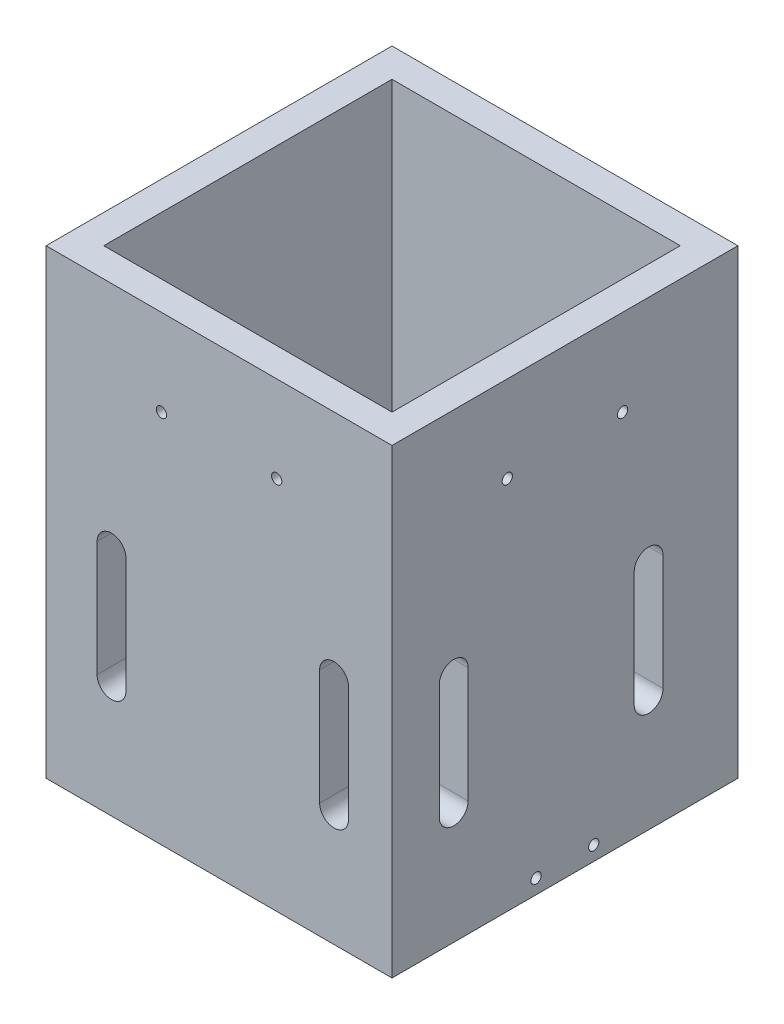
ISO-10303-21;
HEADER;
FILE_DESCRIPTION(('STEP AP214'),'2;1');
FILE_NAME('part.step','',(''),(''),'','','');
FILE_SCHEMA(('AUTOMOTIVE_DESIGN { 1 0 10303 214 1 1 1 1 }'));
ENDSEC;
DATA;
#1=APPLICATION_CONTEXT('core data for automotive mechanical design processes');
#2=APPLICATION_PROTOCOL_DEFINITION('international standard','automotive_design',2000,#1);
#3=PRODUCT_CONTEXT('',#1,'mechanical');
#4=PRODUCT('Part','Part','',(#3));
#5=PRODUCT_RELATED_PRODUCT_CATEGORY('part','',(#4));
#6=PRODUCT_DEFINITION_FORMATION('','',#4);
#7=PRODUCT_DEFINITION_CONTEXT('part definition',#1,'design');
#8=PRODUCT_DEFINITION('design','',#6,#7);
#9=PRODUCT_DEFINITION_SHAPE('','',#8);
#10=(LENGTH_UNIT() NAMED_UNIT(*) SI_UNIT(.MILLI.,.METRE.));
#11=(NAMED_UNIT(*) PLANE_ANGLE_UNIT() SI_UNIT($,.RADIAN.));
#12=(NAMED_UNIT(*) SI_UNIT($,.STERADIAN.) SOLID_ANGLE_UNIT());
#13=UNCERTAINTY_MEASURE_WITH_UNIT(LENGTH_MEASURE(1.E-05),#10,'distance_accuracy_value','');
#14=(GEOMETRIC_REPRESENTATION_CONTEXT(3) GLOBAL_UNCERTAINTY_ASSIGNED_CONTEXT((#13)) GLOBAL_UNIT_ASSIGNED_CONTEXT((#10,
#11,#12)) REPRESENTATION_CONTEXT('',''));
#15=CARTESIAN_POINT('',(0.,0.,0.));
#16=DIRECTION('',(0.,0.,1.));
#17=DIRECTION('',(1.,0.,0.));
#18=AXIS2_PLACEMENT_3D('',#15,#16,#17);
#19=CARTESIAN_POINT('',(-39.4321678321678,101.6,-32.9489510489511));
#20=DIRECTION('',(1.,0.,0.));
#21=DIRECTION('',(0.,0.,-1.));
#22=AXIS2_PLACEMENT_3D('',#19,#20,#21);
#23=PLANE('',#22);
#24=CARTESIAN_POINT('',(-39.4321678321678,3.175,-1.19895104895105));
#25=DIRECTION('',(1.,0.,0.));
#26=DIRECTION('',(0.,0.,-1.));
#27=AXIS2_PLACEMENT_3D('',#24,#25,#26);
#28=CIRCLE('',#27,1.13029999999998);
#29=CARTESIAN_POINT('',(-39.4321678321678,3.175,-2.32925104895103));
#30=VERTEX_POINT('',#29);
#31=EDGE_CURVE('E450',#30,#30,#28,.T.);
#32=ORIENTED_EDGE('',*,*,#31,.T.);
#33=EDGE_LOOP('',(#32));
#34=FACE_BOUND('',#33,.T.);
#35=CARTESIAN_POINT('',(-39.4321678321678,3.175,11.501048951049));
#36=DIRECTION('',(1.,0.,0.));
#37=DIRECTION('',(0.,0.,-1.));
#38=AXIS2_PLACEMENT_3D('',#35,#36,#37);
#39=CIRCLE('',#38,1.13029999999998);
#40=CARTESIAN_POINT('',(-39.4321678321678,3.175,10.370748951049));
#41=VERTEX_POINT('',#40);
#42=EDGE_CURVE('E378',#41,#41,#39,.T.);
#43=ORIENTED_EDGE('',*,*,#42,.T.);
#44=EDGE_LOOP('',(#43));
#45=FACE_BOUND('',#44,.T.);
#46=DIRECTION('',(0.,0.,1.));
#47=VECTOR('',#46,1.);
#48=CARTESIAN_POINT('',(-39.4321678321678,0.,-32.9489510489511));
#49=LINE('',#48,#47);
#50=CARTESIAN_POINT('',(-39.4321678321678,0.,-32.9489510489511));
#51=VERTEX_POINT('',#50);
#52=CARTESIAN_POINT('',(-39.4321678321678,0.,43.251048951049));
#53=VERTEX_POINT('',#52);
#54=EDGE_CURVE('E344',#51,#53,#49,.T.);
#55=ORIENTED_EDGE('',*,*,#54,.T.);
#56=DIRECTION('',(0.,-1.,0.));
#57=VECTOR('',#56,1.);
#58=CARTESIAN_POINT('',(-39.4321678321678,101.6,43.251048951049));
#59=LINE('',#58,#57);
#60=CARTESIAN_POINT('',(-39.4321678321678,101.6,43.251048951049));
#61=VERTEX_POINT('',#60);
#62=EDGE_CURVE('E11',#61,#53,#59,.T.);
#63=ORIENTED_EDGE('',*,*,#62,.F.);
#64=DIRECTION('',(0.,0.,1.));
#65=VECTOR('',#64,1.);
#66=CARTESIAN_POINT('',(-39.4321678321678,101.6,-32.9489510489511));
#67=LINE('',#66,#65);
#68=CARTESIAN_POINT('',(-39.4321678321678,101.6,-32.9489510489511));
#69=VERTEX_POINT('',#68);
#70=EDGE_CURVE('E351',#69,#61,#67,.T.);
#71=ORIENTED_EDGE('',*,*,#70,.F.);
#72=DIRECTION('',(0.,-1.,0.));
#73=VECTOR('',#72,1.);
#74=CARTESIAN_POINT('',(-39.4321678321678,101.6,-32.9489510489511));
#75=LINE('',#74,#73);
#76=EDGE_CURVE('E361',#69,#51,#75,.T.);
#77=ORIENTED_EDGE('',*,*,#76,.T.);
#78=EDGE_LOOP('',(#55,#63,#71,#77));
#79=FACE_BOUND('',#78,.T.);
#80=ADVANCED_FACE('F35',(#34,#45,#79),#23,.F.);
#81=CARTESIAN_POINT('',(-39.4321678321678,101.6,43.251048951049));
#82=DIRECTION('',(0.,0.,-1.));
#83=DIRECTION('',(-1.,0.,0.));
#84=AXIS2_PLACEMENT_3D('',#81,#82,#83);
#85=PLANE('',#84);
#86=CARTESIAN_POINT('',(-14.0321678321678,82.55,43.251048951049));
#87=DIRECTION('',(0.,0.,1.));
#88=DIRECTION('',(1.,0.,0.));
#89=AXIS2_PLACEMENT_3D('',#86,#87,#88);
#90=CIRCLE('',#89,1.13029999999999);
#91=CARTESIAN_POINT('',(-12.9018678321678,82.55,43.251048951049));
#92=VERTEX_POINT('',#91);
#93=EDGE_CURVE('E405',#92,#92,#90,.T.);
#94=ORIENTED_EDGE('',*,*,#93,.F.);
#95=EDGE_LOOP('',(#94));
#96=FACE_BOUND('',#95,.T.);
#97=CARTESIAN_POINT('',(11.3678321678322,82.55,43.251048951049));
#98=DIRECTION('',(0.,0.,1.));
#99=DIRECTION('',(1.,0.,0.));
#100=AXIS2_PLACEMENT_3D('',#97,#98,#99);
#101=CIRCLE('',#100,1.13029999999999);
#102=CARTESIAN_POINT('',(12.4981321678322,82.55,43.251048951049));
#103=VERTEX_POINT('',#102);
#104=EDGE_CURVE('E411',#103,#103,#101,.T.);
#105=ORIENTED_EDGE('',*,*,#104,.F.);
#106=EDGE_LOOP('',(#105));
#107=FACE_BOUND('',#106,.T.);
#108=CARTESIAN_POINT('',(24.0043321678322,50.8,43.251048951049));
#109=DIRECTION('',(0.,0.,1.));
#110=DIRECTION('',(1.,0.,0.));
#111=AXIS2_PLACEMENT_3D('',#108,#109,#110);
#112=CIRCLE('',#111,3.175);
#113=CARTESIAN_POINT('',(27.1793321678322,50.8,43.251048951049));
#114=VERTEX_POINT('',#113);
#115=CARTESIAN_POINT('',(20.8293321678322,50.8,43.251048951049));
#116=VERTEX_POINT('',#115);
#117=EDGE_CURVE('E262',#114,#116,#112,.T.);
#118=ORIENTED_EDGE('',*,*,#117,.F.);
#119=DIRECTION('',(0.,1.,0.));
#120=VECTOR('',#119,1.);
#121=CARTESIAN_POINT('',(27.1793321678322,25.4,43.251048951049));
#122=LINE('',#121,#120);
#123=CARTESIAN_POINT('',(27.1793321678322,25.4,43.251048951049));
#124=VERTEX_POINT('',#123);
#125=EDGE_CURVE('E265',#124,#114,#122,.T.);
#126=ORIENTED_EDGE('',*,*,#125,.F.);
#127=CARTESIAN_POINT('',(24.0043321678322,25.4,43.251048951049));
#128=DIRECTION('',(0.,0.,1.));
#129=DIRECTION('',(1.,0.,0.));
#130=AXIS2_PLACEMENT_3D('',#127,#128,#129);
#131=CIRCLE('',#130,3.175);
#132=CARTESIAN_POINT('',(20.8293321678322,25.4,43.251048951049));
#133=VERTEX_POINT('',#132);
#134=EDGE_CURVE('E268',#133,#124,#131,.T.);
#135=ORIENTED_EDGE('',*,*,#134,.F.);
#136=DIRECTION('',(0.,-1.,0.));
#137=VECTOR('',#136,1.);
#138=CARTESIAN_POINT('',(20.8293321678322,25.4,43.251048951049));
#139=LINE('',#138,#137);
#140=EDGE_CURVE('E259',#116,#133,#139,.T.);
#141=ORIENTED_EDGE('',*,*,#140,.F.);
#142=EDGE_LOOP('',(#118,#126,#135,#141));
#143=FACE_BOUND('',#142,.T.);
#144=CARTESIAN_POINT('',(-25.0176678321678,50.8,43.251048951049));
#145=DIRECTION('',(0.,0.,1.));
#146=DIRECTION('',(1.,0.,0.));
#147=AXIS2_PLACEMENT_3D('',#144,#145,#146);
#148=CIRCLE('',#147,3.17499999999999);
#149=CARTESIAN_POINT('',(-21.8426678321678,50.8,43.251048951049));
#150=VERTEX_POINT('',#149);
#151=CARTESIAN_POINT('',(-28.1926678321678,50.8,43.251048951049));
#152=VERTEX_POINT('',#151);
#153=EDGE_CURVE('E293',#150,#152,#148,.T.);
#154=ORIENTED_EDGE('',*,*,#153,.F.);
#155=DIRECTION('',(0.,1.,0.));
#156=VECTOR('',#155,1.);
#157=CARTESIAN_POINT('',(-21.8426678321678,25.4,43.251048951049));
#158=LINE('',#157,#156);
#159=CARTESIAN_POINT('',(-21.8426678321678,25.4,43.251048951049));
#160=VERTEX_POINT('',#159);
#161=EDGE_CURVE('E296',#160,#150,#158,.T.);
#162=ORIENTED_EDGE('',*,*,#161,.F.);
#163=CARTESIAN_POINT('',(-25.0176678321678,25.4,43.251048951049));
#164=DIRECTION('',(0.,0.,1.));
#165=DIRECTION('',(1.,0.,0.));
#166=AXIS2_PLACEMENT_3D('',#163,#164,#165);
#167=CIRCLE('',#166,3.17499999999999);
#168=CARTESIAN_POINT('',(-28.1926678321678,25.4,43.251048951049));
#169=VERTEX_POINT('',#168);
#170=EDGE_CURVE('E299',#169,#160,#167,.T.);
#171=ORIENTED_EDGE('',*,*,#170,.F.);
#172=DIRECTION('',(0.,-1.,0.));
#173=VECTOR('',#172,1.);
#174=CARTESIAN_POINT('',(-28.1926678321678,25.4,43.251048951049));
#175=LINE('',#174,#173);
#176=EDGE_CURVE('E290',#152,#169,#175,.T.);
#177=ORIENTED_EDGE('',*,*,#176,.F.);
#178=EDGE_LOOP('',(#154,#162,#171,#177));
#179=FACE_BOUND('',#178,.T.);
#180=DIRECTION('',(1.,0.,0.));
#181=VECTOR('',#180,1.);
#182=CARTESIAN_POINT('',(-39.4321678321678,0.,43.251048951049));
#183=LINE('',#182,#181);
#184=CARTESIAN_POINT('',(36.7678321678322,0.,43.251048951049));
#185=VERTEX_POINT('',#184);
#186=EDGE_CURVE('E364',#53,#185,#183,.T.);
#187=ORIENTED_EDGE('',*,*,#186,.T.);
#188=DIRECTION('',(0.,-1.,0.));
#189=VECTOR('',#188,1.);
#190=CARTESIAN_POINT('',(36.7678321678322,101.6,43.251048951049));
#191=LINE('',#190,#189);
#192=CARTESIAN_POINT('',(36.7678321678322,101.6,43.251048951049));
#193=VERTEX_POINT('',#192);
#194=EDGE_CURVE('E43',#193,#185,#191,.T.);
#195=ORIENTED_EDGE('',*,*,#194,.F.);
#196=DIRECTION('',(1.,0.,0.));
#197=VECTOR('',#196,1.);
#198=CARTESIAN_POINT('',(-39.4321678321678,101.6,43.251048951049));
#199=LINE('',#198,#197);
#200=EDGE_CURVE('E354',#61,#193,#199,.T.);
#201=ORIENTED_EDGE('',*,*,#200,.F.);
#202=ORIENTED_EDGE('',*,*,#62,.T.);
#203=EDGE_LOOP('',(#187,#195,#201,#202));
#204=FACE_BOUND('',#203,.T.);
#205=ADVANCED_FACE('F442',(#96,#107,#143,#179,#204),#85,.F.);
#206=CARTESIAN_POINT('',(36.7678321678322,101.6,-32.9489510489511));
#207=DIRECTION('',(-1.,0.,0.));
#208=DIRECTION('',(0.,0.,1.));
#209=AXIS2_PLACEMENT_3D('',#206,#207,#208);
#210=PLANE('',#209);
#211=CARTESIAN_POINT('',(36.7678321678322,3.175,-1.19895104895106));
#212=DIRECTION('',(1.,0.,0.));
#213=DIRECTION('',(0.,0.,-1.));
#214=AXIS2_PLACEMENT_3D('',#211,#212,#213);
#215=CIRCLE('',#214,1.13029999999999);
#216=CARTESIAN_POINT('',(36.7678321678322,3.175,-2.32925104895105));
#217=VERTEX_POINT('',#216);
#218=EDGE_CURVE('E733',#217,#217,#215,.T.);
#219=ORIENTED_EDGE('',*,*,#218,.F.);
#220=EDGE_LOOP('',(#219));
#221=FACE_BOUND('',#220,.T.);
#222=CARTESIAN_POINT('',(36.7678321678322,3.175,11.5010489510489));
#223=DIRECTION('',(1.,0.,0.));
#224=DIRECTION('',(0.,0.,-1.));
#225=AXIS2_PLACEMENT_3D('',#222,#223,#224);
#226=CIRCLE('',#225,1.13029999999999);
#227=CARTESIAN_POINT('',(36.7678321678322,3.175,10.370748951049));
#228=VERTEX_POINT('',#227);
#229=EDGE_CURVE('E385',#228,#228,#226,.T.);
#230=ORIENTED_EDGE('',*,*,#229,.F.);
#231=EDGE_LOOP('',(#230));
#232=FACE_BOUND('',#231,.T.);
#233=CARTESIAN_POINT('',(36.7678321678322,82.55,17.851048951049));
#234=DIRECTION('',(1.,0.,0.));
#235=DIRECTION('',(0.,0.,-1.));
#236=AXIS2_PLACEMENT_3D('',#233,#234,#235);
#237=CIRCLE('',#236,1.13029999999999);
#238=CARTESIAN_POINT('',(36.7678321678322,82.55,16.720748951049));
#239=VERTEX_POINT('',#238);
#240=EDGE_CURVE('E382',#239,#239,#237,.T.);
#241=ORIENTED_EDGE('',*,*,#240,.F.);
#242=EDGE_LOOP('',(#241));
#243=FACE_BOUND('',#242,.T.);
#244=CARTESIAN_POINT('',(36.7678321678322,82.55,-7.54895104895105));
#245=DIRECTION('',(1.,0.,0.));
#246=DIRECTION('',(0.,0.,-1.));
#247=AXIS2_PLACEMENT_3D('',#244,#245,#246);
#248=CIRCLE('',#247,1.13029999999999);
#249=CARTESIAN_POINT('',(36.7678321678322,82.55,-8.67925104895104));
#250=VERTEX_POINT('',#249);
#251=EDGE_CURVE('E399',#250,#250,#248,.T.);
#252=ORIENTED_EDGE('',*,*,#251,.F.);
#253=EDGE_LOOP('',(#252));
#254=FACE_BOUND('',#253,.T.);
#255=CARTESIAN_POINT('',(36.7678321678322,50.8,-13.276651048951));
#256=DIRECTION('',(1.,0.,0.));
#257=DIRECTION('',(0.,0.,-1.));
#258=AXIS2_PLACEMENT_3D('',#255,#256,#257);
#259=CIRCLE('',#258,3.175);
#260=CARTESIAN_POINT('',(36.7678321678322,50.8,-16.451651048951));
#261=VERTEX_POINT('',#260);
#262=CARTESIAN_POINT('',(36.7678321678322,50.8,-10.101651048951));
#263=VERTEX_POINT('',#262);
#264=EDGE_CURVE('E419',#261,#263,#259,.T.);
#265=ORIENTED_EDGE('',*,*,#264,.F.);
#266=DIRECTION('',(0.,1.,0.));
#267=VECTOR('',#266,1.);
#268=CARTESIAN_POINT('',(36.7678321678322,25.4,-16.451651048951));
#269=LINE('',#268,#267);
#270=CARTESIAN_POINT('',(36.7678321678322,25.4,-16.451651048951));
#271=VERTEX_POINT('',#270);
#272=EDGE_CURVE('E422',#271,#261,#269,.T.);
#273=ORIENTED_EDGE('',*,*,#272,.F.);
#274=CARTESIAN_POINT('',(36.7678321678322,25.4,-13.276651048951));
#275=DIRECTION('',(1.,0.,0.));
#276=DIRECTION('',(0.,0.,-1.));
#277=AXIS2_PLACEMENT_3D('',#274,#275,#276);
#278=CIRCLE('',#277,3.175);
#279=CARTESIAN_POINT('',(36.7678321678322,25.4,-10.101651048951));
#280=VERTEX_POINT('',#279);
#281=EDGE_CURVE('E217',#280,#271,#278,.T.);
#282=ORIENTED_EDGE('',*,*,#281,.F.);
#283=DIRECTION('',(0.,-1.,0.));
#284=VECTOR('',#283,1.);
#285=CARTESIAN_POINT('',(36.7678321678322,25.4,-10.101651048951));
#286=LINE('',#285,#284);
#287=EDGE_CURVE('E51',#263,#280,#286,.T.);
#288=ORIENTED_EDGE('',*,*,#287,.F.);
#289=EDGE_LOOP('',(#265,#273,#282,#288));
#290=FACE_BOUND('',#289,.T.);
#291=CARTESIAN_POINT('',(36.7678321678322,50.8,29.649348951049));
#292=DIRECTION('',(1.,0.,0.));
#293=DIRECTION('',(0.,0.,-1.));
#294=AXIS2_PLACEMENT_3D('',#291,#292,#293);
#295=CIRCLE('',#294,3.175);
#296=CARTESIAN_POINT('',(36.7678321678322,50.8,26.474348951049));
#297=VERTEX_POINT('',#296);
#298=CARTESIAN_POINT('',(36.7678321678322,50.8,32.824348951049));
#299=VERTEX_POINT('',#298);
#300=EDGE_CURVE('E231',#297,#299,#295,.T.);
#301=ORIENTED_EDGE('',*,*,#300,.F.);
#302=DIRECTION('',(0.,1.,0.));
#303=VECTOR('',#302,1.);
#304=CARTESIAN_POINT('',(36.7678321678322,25.4,26.474348951049));
#305=LINE('',#304,#303);
#306=CARTESIAN_POINT('',(36.7678321678322,25.4,26.474348951049));
#307=VERTEX_POINT('',#306);
#308=EDGE_CURVE('E234',#307,#297,#305,.T.);
#309=ORIENTED_EDGE('',*,*,#308,.F.);
#310=CARTESIAN_POINT('',(36.7678321678322,25.4,29.649348951049));
#311=DIRECTION('',(1.,0.,0.));
#312=DIRECTION('',(0.,0.,-1.));
#313=AXIS2_PLACEMENT_3D('',#310,#311,#312);
#314=CIRCLE('',#313,3.175);
#315=CARTESIAN_POINT('',(36.7678321678322,25.4,32.824348951049));
#316=VERTEX_POINT('',#315);
#317=EDGE_CURVE('E237',#316,#307,#314,.T.);
#318=ORIENTED_EDGE('',*,*,#317,.F.);
#319=DIRECTION('',(0.,-1.,0.));
#320=VECTOR('',#319,1.);
#321=CARTESIAN_POINT('',(36.7678321678322,25.4,32.824348951049));
#322=LINE('',#321,#320);
#323=EDGE_CURVE('E228',#299,#316,#322,.T.);
#324=ORIENTED_EDGE('',*,*,#323,.F.);
#325=EDGE_LOOP('',(#301,#309,#318,#324));
#326=FACE_BOUND('',#325,.T.);
#327=DIRECTION('',(0.,0.,-1.));
#328=VECTOR('',#327,1.);
#329=CARTESIAN_POINT('',(36.7678321678322,0.,-32.9489510489511));
#330=LINE('',#329,#328);
#331=CARTESIAN_POINT('',(36.7678321678322,0.,-32.9489510489511));
#332=VERTEX_POINT('',#331);
#333=EDGE_CURVE('E366',#185,#332,#330,.T.);
#334=ORIENTED_EDGE('',*,*,#333,.T.);
#335=DIRECTION('',(0.,-1.,0.));
#336=VECTOR('',#335,1.);
#337=CARTESIAN_POINT('',(36.7678321678322,101.6,-32.9489510489511));
#338=LINE('',#337,#336);
#339=CARTESIAN_POINT('',(36.7678321678322,101.6,-32.9489510489511));
#340=VERTEX_POINT('',#339);
#341=EDGE_CURVE('E371',#340,#332,#338,.T.);
#342=ORIENTED_EDGE('',*,*,#341,.F.);
#343=DIRECTION('',(0.,0.,-1.));
#344=VECTOR('',#343,1.);
#345=CARTESIAN_POINT('',(36.7678321678322,101.6,-32.9489510489511));
#346=LINE('',#345,#344);
#347=EDGE_CURVE('E357',#193,#340,#346,.T.);
#348=ORIENTED_EDGE('',*,*,#347,.F.);
#349=ORIENTED_EDGE('',*,*,#194,.T.);
#350=EDGE_LOOP('',(#334,#342,#348,#349));
#351=FACE_BOUND('',#350,.T.);
#352=ADVANCED_FACE('F427',(#221,#232,#243,#254,#290,#326,#351),#210,.F.);
#353=CARTESIAN_POINT('',(-39.4321678321678,101.6,-32.9489510489511));
#354=DIRECTION('',(0.,0.,1.));
#355=DIRECTION('',(1.,0.,0.));
#356=AXIS2_PLACEMENT_3D('',#353,#354,#355);
#357=PLANE('',#356);
#358=DIRECTION('',(-1.,0.,0.));
#359=VECTOR('',#358,1.);
#360=CARTESIAN_POINT('',(-39.4321678321678,0.,-32.9489510489511));
#361=LINE('',#360,#359);
#362=EDGE_CURVE('E355',#332,#51,#361,.T.);
#363=ORIENTED_EDGE('',*,*,#362,.T.);
#364=ORIENTED_EDGE('',*,*,#76,.F.);
#365=DIRECTION('',(-1.,0.,0.));
#366=VECTOR('',#365,1.);
#367=CARTESIAN_POINT('',(-39.4321678321678,101.6,-32.9489510489511));
#368=LINE('',#367,#366);
#369=EDGE_CURVE('E359',#340,#69,#368,.T.);
#370=ORIENTED_EDGE('',*,*,#369,.F.);
#371=ORIENTED_EDGE('',*,*,#341,.T.);
#372=EDGE_LOOP('',(#363,#364,#370,#371));
#373=FACE_BOUND('',#372,.T.);
#374=ADVANCED_FACE('F468',(#373),#357,.F.);
#375=CARTESIAN_POINT('',(0.,101.6,0.));
#376=DIRECTION('',(0.,1.,0.));
#377=DIRECTION('',(0.,0.,1.));
#378=AXIS2_PLACEMENT_3D('',#375,#376,#377);
#379=PLANE('',#378);
#380=DIRECTION('',(0.,0.,1.));
#381=VECTOR('',#380,1.);
#382=CARTESIAN_POINT('',(-33.0821678321678,101.6,-26.598951048951));
#383=LINE('',#382,#381);
#384=CARTESIAN_POINT('',(-33.0821678321678,101.6,-26.598951048951));
#385=VERTEX_POINT('',#384);
#386=CARTESIAN_POINT('',(-33.0821678321678,101.6,36.901048951049));
#387=VERTEX_POINT('',#386);
#388=EDGE_CURVE('E318',#385,#387,#383,.T.);
#389=ORIENTED_EDGE('',*,*,#388,.F.);
#390=DIRECTION('',(-1.,0.,0.));
#391=VECTOR('',#390,1.);
#392=CARTESIAN_POINT('',(-33.0821678321678,101.6,-26.598951048951));
#393=LINE('',#392,#391);
#394=CARTESIAN_POINT('',(30.4178321678322,101.6,-26.598951048951));
#395=VERTEX_POINT('',#394);
#396=EDGE_CURVE('E323',#395,#385,#393,.T.);
#397=ORIENTED_EDGE('',*,*,#396,.F.);
#398=DIRECTION('',(0.,0.,-1.));
#399=VECTOR('',#398,1.);
#400=CARTESIAN_POINT('',(30.4178321678322,101.6,-26.598951048951));
#401=LINE('',#400,#399);
#402=CARTESIAN_POINT('',(30.4178321678322,101.6,36.901048951049));
#403=VERTEX_POINT('',#402);
#404=EDGE_CURVE('E337',#403,#395,#401,.T.);
#405=ORIENTED_EDGE('',*,*,#404,.F.);
#406=DIRECTION('',(1.,0.,0.));
#407=VECTOR('',#406,1.);
#408=CARTESIAN_POINT('',(-33.0821678321678,101.6,36.901048951049));
#409=LINE('',#408,#407);
#410=EDGE_CURVE('E334',#387,#403,#409,.T.);
#411=ORIENTED_EDGE('',*,*,#410,.F.);
#412=EDGE_LOOP('',(#389,#397,#405,#411));
#413=FACE_BOUND('',#412,.T.);
#414=ORIENTED_EDGE('',*,*,#70,.T.);
#415=ORIENTED_EDGE('',*,*,#200,.T.);
#416=ORIENTED_EDGE('',*,*,#347,.T.);
#417=ORIENTED_EDGE('',*,*,#369,.T.);
#418=EDGE_LOOP('',(#414,#415,#416,#417));
#419=FACE_BOUND('',#418,.T.);
#420=ADVANCED_FACE('F464',(#413,#419),#379,.T.);
#421=CARTESIAN_POINT('',(0.,0.,0.));
#422=DIRECTION('',(0.,1.,0.));
#423=DIRECTION('',(0.,0.,1.));
#424=AXIS2_PLACEMENT_3D('',#421,#422,#423);
#425=PLANE('',#424);
#426=DIRECTION('',(-1.,0.,0.));
#427=VECTOR('',#426,1.);
#428=CARTESIAN_POINT('',(-33.0821678321678,0.,-26.598951048951));
#429=LINE('',#428,#427);
#430=CARTESIAN_POINT('',(30.4178321678322,0.,-26.598951048951));
#431=VERTEX_POINT('',#430);
#432=CARTESIAN_POINT('',(-33.0821678321678,0.,-26.598951048951));
#433=VERTEX_POINT('',#432);
#434=EDGE_CURVE('E329',#431,#433,#429,.T.);
#435=ORIENTED_EDGE('',*,*,#434,.T.);
#436=DIRECTION('',(0.,0.,1.));
#437=VECTOR('',#436,1.);
#438=CARTESIAN_POINT('',(-33.0821678321678,0.,-26.598951048951));
#439=LINE('',#438,#437);
#440=CARTESIAN_POINT('',(-33.0821678321678,0.,36.901048951049));
#441=VERTEX_POINT('',#440);
#442=EDGE_CURVE('E319',#433,#441,#439,.T.);
#443=ORIENTED_EDGE('',*,*,#442,.T.);
#444=DIRECTION('',(1.,0.,0.));
#445=VECTOR('',#444,1.);
#446=CARTESIAN_POINT('',(-33.0821678321678,0.,36.901048951049));
#447=LINE('',#446,#445);
#448=CARTESIAN_POINT('',(30.4178321678322,0.,36.901048951049));
#449=VERTEX_POINT('',#448);
#450=EDGE_CURVE('E322',#441,#449,#447,.T.);
#451=ORIENTED_EDGE('',*,*,#450,.T.);
#452=DIRECTION('',(0.,0.,-1.));
#453=VECTOR('',#452,1.);
#454=CARTESIAN_POINT('',(30.4178321678322,0.,-26.598951048951));
#455=LINE('',#454,#453);
#456=EDGE_CURVE('E326',#449,#431,#455,.T.);
#457=ORIENTED_EDGE('',*,*,#456,.T.);
#458=EDGE_LOOP('',(#435,#443,#451,#457));
#459=FACE_BOUND('',#458,.T.);
#460=ORIENTED_EDGE('',*,*,#54,.F.);
#461=ORIENTED_EDGE('',*,*,#362,.F.);
#462=ORIENTED_EDGE('',*,*,#333,.F.);
#463=ORIENTED_EDGE('',*,*,#186,.F.);
#464=EDGE_LOOP('',(#460,#461,#462,#463));
#465=FACE_BOUND('',#464,.T.);
#466=ADVANCED_FACE('F458',(#459,#465),#425,.F.);
#467=CARTESIAN_POINT('',(-33.0821678321678,0.,-26.598951048951));
#468=DIRECTION('',(-1.,0.,0.));
#469=DIRECTION('',(0.,0.,1.));
#470=AXIS2_PLACEMENT_3D('',#467,#468,#469);
#471=PLANE('',#470);
#472=CARTESIAN_POINT('',(-33.0821678321678,3.175,-1.19895104895105));
#473=DIRECTION('',(-1.,0.,0.));
#474=DIRECTION('',(0.,0.,1.));
#475=AXIS2_PLACEMENT_3D('',#472,#473,#474);
#476=CIRCLE('',#475,1.13029999999999);
#477=CARTESIAN_POINT('',(-33.0821678321678,3.175,-0.0686510489510636));
#478=VERTEX_POINT('',#477);
#479=EDGE_CURVE('E390',#478,#478,#476,.T.);
#480=ORIENTED_EDGE('',*,*,#479,.T.);
#481=EDGE_LOOP('',(#480));
#482=FACE_BOUND('',#481,.T.);
#483=CARTESIAN_POINT('',(-33.0821678321678,3.175,11.501048951049));
#484=DIRECTION('',(-1.,0.,0.));
#485=DIRECTION('',(0.,0.,1.));
#486=AXIS2_PLACEMENT_3D('',#483,#484,#485);
#487=CIRCLE('',#486,1.13029999999999);
#488=CARTESIAN_POINT('',(-33.0821678321678,3.175,12.6313489510489));
#489=VERTEX_POINT('',#488);
#490=EDGE_CURVE('E377',#489,#489,#487,.T.);
#491=ORIENTED_EDGE('',*,*,#490,.T.);
#492=EDGE_LOOP('',(#491));
#493=FACE_BOUND('',#492,.T.);
#494=ORIENTED_EDGE('',*,*,#388,.T.);
#495=DIRECTION('',(0.,1.,0.));
#496=VECTOR('',#495,1.);
#497=CARTESIAN_POINT('',(-33.0821678321678,0.,36.901048951049));
#498=LINE('',#497,#496);
#499=EDGE_CURVE('E332',#441,#387,#498,.T.);
#500=ORIENTED_EDGE('',*,*,#499,.F.);
#501=ORIENTED_EDGE('',*,*,#442,.F.);
#502=DIRECTION('',(0.,1.,0.));
#503=VECTOR('',#502,1.);
#504=CARTESIAN_POINT('',(-33.0821678321678,0.,-26.598951048951));
#505=LINE('',#504,#503);
#506=EDGE_CURVE('E342',#433,#385,#505,.T.);
#507=ORIENTED_EDGE('',*,*,#506,.T.);
#508=EDGE_LOOP('',(#494,#500,#501,#507));
#509=FACE_BOUND('',#508,.T.);
#510=ADVANCED_FACE('F482',(#482,#493,#509),#471,.F.);
#511=CARTESIAN_POINT('',(-33.0821678321678,0.,-26.598951048951));
#512=DIRECTION('',(0.,0.,-1.));
#513=DIRECTION('',(-1.,0.,0.));
#514=AXIS2_PLACEMENT_3D('',#511,#512,#513);
#515=PLANE('',#514);
#516=ORIENTED_EDGE('',*,*,#396,.T.);
#517=ORIENTED_EDGE('',*,*,#506,.F.);
#518=ORIENTED_EDGE('',*,*,#434,.F.);
#519=DIRECTION('',(0.,1.,0.));
#520=VECTOR('',#519,1.);
#521=CARTESIAN_POINT('',(30.4178321678322,0.,-26.598951048951));
#522=LINE('',#521,#520);
#523=EDGE_CURVE('E345',#431,#395,#522,.T.);
#524=ORIENTED_EDGE('',*,*,#523,.T.);
#525=EDGE_LOOP('',(#516,#517,#518,#524));
#526=FACE_BOUND('',#525,.T.);
#527=ADVANCED_FACE('F489',(#526),#515,.F.);
#528=CARTESIAN_POINT('',(30.4178321678322,0.,-26.598951048951));
#529=DIRECTION('',(1.,0.,0.));
#530=DIRECTION('',(0.,0.,-1.));
#531=AXIS2_PLACEMENT_3D('',#528,#529,#530);
#532=PLANE('',#531);
#533=CARTESIAN_POINT('',(30.4178321678322,3.175,-1.19895104895106));
#534=DIRECTION('',(1.,0.,0.));
#535=DIRECTION('',(0.,0.,-1.));
#536=AXIS2_PLACEMENT_3D('',#533,#534,#535);
#537=CIRCLE('',#536,1.13029999999999);
#538=CARTESIAN_POINT('',(30.4178321678322,3.175,-2.32925104895105));
#539=VERTEX_POINT('',#538);
#540=EDGE_CURVE('E38',#539,#539,#537,.T.);
#541=ORIENTED_EDGE('',*,*,#540,.T.);
#542=EDGE_LOOP('',(#541));
#543=FACE_BOUND('',#542,.T.);
#544=CARTESIAN_POINT('',(30.4178321678322,3.175,11.5010489510489));
#545=DIRECTION('',(1.,0.,0.));
#546=DIRECTION('',(0.,0.,-1.));
#547=AXIS2_PLACEMENT_3D('',#544,#545,#546);
#548=CIRCLE('',#547,1.13029999999999);
#549=CARTESIAN_POINT('',(30.4178321678322,3.175,10.370748951049));
#550=VERTEX_POINT('',#549);
#551=EDGE_CURVE('E375',#550,#550,#548,.T.);
#552=ORIENTED_EDGE('',*,*,#551,.T.);
#553=EDGE_LOOP('',(#552));
#554=FACE_BOUND('',#553,.T.);
#555=CARTESIAN_POINT('',(30.4178321678322,82.55,17.851048951049));
#556=DIRECTION('',(1.,0.,0.));
#557=DIRECTION('',(0.,0.,-1.));
#558=AXIS2_PLACEMENT_3D('',#555,#556,#557);
#559=CIRCLE('',#558,1.13029999999999);
#560=CARTESIAN_POINT('',(30.4178321678322,82.55,16.720748951049));
#561=VERTEX_POINT('',#560);
#562=EDGE_CURVE('E396',#561,#561,#559,.T.);
#563=ORIENTED_EDGE('',*,*,#562,.T.);
#564=EDGE_LOOP('',(#563));
#565=FACE_BOUND('',#564,.T.);
#566=CARTESIAN_POINT('',(30.4178321678322,82.55,-7.54895104895105));
#567=DIRECTION('',(1.,0.,0.));
#568=DIRECTION('',(0.,0.,-1.));
#569=AXIS2_PLACEMENT_3D('',#566,#567,#568);
#570=CIRCLE('',#569,1.13029999999999);
#571=CARTESIAN_POINT('',(30.4178321678322,82.55,-8.67925104895104));
#572=VERTEX_POINT('',#571);
#573=EDGE_CURVE('E402',#572,#572,#570,.T.);
#574=ORIENTED_EDGE('',*,*,#573,.T.);
#575=EDGE_LOOP('',(#574));
#576=FACE_BOUND('',#575,.T.);
#577=CARTESIAN_POINT('',(30.4178321678322,25.4,-13.276651048951));
#578=DIRECTION('',(1.,0.,0.));
#579=DIRECTION('',(0.,0.,-1.));
#580=AXIS2_PLACEMENT_3D('',#577,#578,#579);
#581=CIRCLE('',#580,3.175);
#582=CARTESIAN_POINT('',(30.4178321678322,25.4,-16.451651048951));
#583=VERTEX_POINT('',#582);
#584=CARTESIAN_POINT('',(30.4178321678322,25.4,-10.101651048951));
#585=VERTEX_POINT('',#584);
#586=EDGE_CURVE('E208',#583,#585,#581,.F.);
#587=ORIENTED_EDGE('',*,*,#586,.F.);
#588=DIRECTION('',(0.,-1.,0.));
#589=VECTOR('',#588,1.);
#590=CARTESIAN_POINT('',(30.4178321678322,25.4,-16.451651048951));
#591=LINE('',#590,#589);
#592=CARTESIAN_POINT('',(30.4178321678322,50.8,-16.451651048951));
#593=VERTEX_POINT('',#592);
#594=EDGE_CURVE('E59',#593,#583,#591,.T.);
#595=ORIENTED_EDGE('',*,*,#594,.F.);
#596=CARTESIAN_POINT('',(30.4178321678322,50.8,-13.276651048951));
#597=DIRECTION('',(1.,0.,0.));
#598=DIRECTION('',(0.,0.,-1.));
#599=AXIS2_PLACEMENT_3D('',#596,#597,#598);
#600=CIRCLE('',#599,3.175);
#601=CARTESIAN_POINT('',(30.4178321678322,50.8,-10.101651048951));
#602=VERTEX_POINT('',#601);
#603=EDGE_CURVE('E215',#602,#593,#600,.F.);
#604=ORIENTED_EDGE('',*,*,#603,.F.);
#605=DIRECTION('',(0.,1.,0.));
#606=VECTOR('',#605,1.);
#607=CARTESIAN_POINT('',(30.4178321678322,25.4,-10.101651048951));
#608=LINE('',#607,#606);
#609=EDGE_CURVE('E199',#585,#602,#608,.T.);
#610=ORIENTED_EDGE('',*,*,#609,.F.);
#611=EDGE_LOOP('',(#587,#595,#604,#610));
#612=FACE_BOUND('',#611,.T.);
#613=CARTESIAN_POINT('',(30.4178321678322,25.4,29.649348951049));
#614=DIRECTION('',(1.,0.,0.));
#615=DIRECTION('',(0.,0.,-1.));
#616=AXIS2_PLACEMENT_3D('',#613,#614,#615);
#617=CIRCLE('',#616,3.175);
#618=CARTESIAN_POINT('',(30.4178321678322,25.4,26.474348951049));
#619=VERTEX_POINT('',#618);
#620=CARTESIAN_POINT('',(30.4178321678322,25.4,32.824348951049));
#621=VERTEX_POINT('',#620);
#622=EDGE_CURVE('E227',#619,#621,#617,.F.);
#623=ORIENTED_EDGE('',*,*,#622,.F.);
#624=DIRECTION('',(0.,-1.,0.));
#625=VECTOR('',#624,1.);
#626=CARTESIAN_POINT('',(30.4178321678322,25.4,26.474348951049));
#627=LINE('',#626,#625);
#628=CARTESIAN_POINT('',(30.4178321678322,50.8,26.474348951049));
#629=VERTEX_POINT('',#628);
#630=EDGE_CURVE('E225',#629,#619,#627,.T.);
#631=ORIENTED_EDGE('',*,*,#630,.F.);
#632=CARTESIAN_POINT('',(30.4178321678322,50.8,29.649348951049));
#633=DIRECTION('',(1.,0.,0.));
#634=DIRECTION('',(0.,0.,-1.));
#635=AXIS2_PLACEMENT_3D('',#632,#633,#634);
#636=CIRCLE('',#635,3.175);
#637=CARTESIAN_POINT('',(30.4178321678322,50.8,32.824348951049));
#638=VERTEX_POINT('',#637);
#639=EDGE_CURVE('E240',#638,#629,#636,.F.);
#640=ORIENTED_EDGE('',*,*,#639,.F.);
#641=DIRECTION('',(0.,1.,0.));
#642=VECTOR('',#641,1.);
#643=CARTESIAN_POINT('',(30.4178321678322,25.4,32.824348951049));
#644=LINE('',#643,#642);
#645=EDGE_CURVE('E243',#621,#638,#644,.T.);
#646=ORIENTED_EDGE('',*,*,#645,.F.);
#647=EDGE_LOOP('',(#623,#631,#640,#646));
#648=FACE_BOUND('',#647,.T.);
#649=ORIENTED_EDGE('',*,*,#404,.T.);
#650=ORIENTED_EDGE('',*,*,#523,.F.);
#651=ORIENTED_EDGE('',*,*,#456,.F.);
#652=DIRECTION('',(0.,1.,0.));
#653=VECTOR('',#652,1.);
#654=CARTESIAN_POINT('',(30.4178321678322,0.,36.901048951049));
#655=LINE('',#654,#653);
#656=EDGE_CURVE('E347',#449,#403,#655,.T.);
#657=ORIENTED_EDGE('',*,*,#656,.T.);
#658=EDGE_LOOP('',(#649,#650,#651,#657));
#659=FACE_BOUND('',#658,.T.);
#660=ADVANCED_FACE('F212',(#543,#554,#565,#576,#612,#648,#659),#532,.F.);
#661=CARTESIAN_POINT('',(-33.0821678321678,0.,36.901048951049));
#662=DIRECTION('',(0.,0.,1.));
#663=DIRECTION('',(1.,0.,0.));
#664=AXIS2_PLACEMENT_3D('',#661,#662,#663);
#665=PLANE('',#664);
#666=CARTESIAN_POINT('',(-14.0321678321678,82.55,36.901048951049));
#667=DIRECTION('',(0.,0.,1.));
#668=DIRECTION('',(1.,0.,0.));
#669=AXIS2_PLACEMENT_3D('',#666,#667,#668);
#670=CIRCLE('',#669,1.13029999999999);
#671=CARTESIAN_POINT('',(-12.9018678321678,82.55,36.901048951049));
#672=VERTEX_POINT('',#671);
#673=EDGE_CURVE('E408',#672,#672,#670,.T.);
#674=ORIENTED_EDGE('',*,*,#673,.T.);
#675=EDGE_LOOP('',(#674));
#676=FACE_BOUND('',#675,.T.);
#677=CARTESIAN_POINT('',(11.3678321678322,82.55,36.901048951049));
#678=DIRECTION('',(0.,0.,1.));
#679=DIRECTION('',(1.,0.,0.));
#680=AXIS2_PLACEMENT_3D('',#677,#678,#679);
#681=CIRCLE('',#680,1.13029999999999);
#682=CARTESIAN_POINT('',(12.4981321678322,82.55,36.901048951049));
#683=VERTEX_POINT('',#682);
#684=EDGE_CURVE('E414',#683,#683,#681,.T.);
#685=ORIENTED_EDGE('',*,*,#684,.T.);
#686=EDGE_LOOP('',(#685));
#687=FACE_BOUND('',#686,.T.);
#688=CARTESIAN_POINT('',(24.0043321678322,25.4,36.9010489510489));
#689=DIRECTION('',(0.,0.,1.));
#690=DIRECTION('',(1.,0.,0.));
#691=AXIS2_PLACEMENT_3D('',#688,#689,#690);
#692=CIRCLE('',#691,3.175);
#693=CARTESIAN_POINT('',(27.1793321678322,25.4,36.9010489510489));
#694=VERTEX_POINT('',#693);
#695=CARTESIAN_POINT('',(20.8293321678322,25.4,36.9010489510489));
#696=VERTEX_POINT('',#695);
#697=EDGE_CURVE('E258',#694,#696,#692,.F.);
#698=ORIENTED_EDGE('',*,*,#697,.F.);
#699=DIRECTION('',(0.,-1.,0.));
#700=VECTOR('',#699,1.);
#701=CARTESIAN_POINT('',(27.1793321678322,25.4,36.9010489510489));
#702=LINE('',#701,#700);
#703=CARTESIAN_POINT('',(27.1793321678322,50.8,36.9010489510489));
#704=VERTEX_POINT('',#703);
#705=EDGE_CURVE('E256',#704,#694,#702,.T.);
#706=ORIENTED_EDGE('',*,*,#705,.F.);
#707=CARTESIAN_POINT('',(24.0043321678322,50.8,36.9010489510489));
#708=DIRECTION('',(0.,0.,1.));
#709=DIRECTION('',(1.,0.,0.));
#710=AXIS2_PLACEMENT_3D('',#707,#708,#709);
#711=CIRCLE('',#710,3.175);
#712=CARTESIAN_POINT('',(20.8293321678322,50.8,36.9010489510489));
#713=VERTEX_POINT('',#712);
#714=EDGE_CURVE('E271',#713,#704,#711,.F.);
#715=ORIENTED_EDGE('',*,*,#714,.F.);
#716=DIRECTION('',(0.,1.,0.));
#717=VECTOR('',#716,1.);
#718=CARTESIAN_POINT('',(20.8293321678322,25.4,36.9010489510489));
#719=LINE('',#718,#717);
#720=EDGE_CURVE('E274',#696,#713,#719,.T.);
#721=ORIENTED_EDGE('',*,*,#720,.F.);
#722=EDGE_LOOP('',(#698,#706,#715,#721));
#723=FACE_BOUND('',#722,.T.);
#724=CARTESIAN_POINT('',(-25.0176678321678,25.4,36.9010489510489));
#725=DIRECTION('',(0.,0.,1.));
#726=DIRECTION('',(1.,0.,0.));
#727=AXIS2_PLACEMENT_3D('',#724,#725,#726);
#728=CIRCLE('',#727,3.17499999999999);
#729=CARTESIAN_POINT('',(-21.8426678321678,25.4,36.9010489510489));
#730=VERTEX_POINT('',#729);
#731=CARTESIAN_POINT('',(-28.1926678321678,25.4,36.9010489510489));
#732=VERTEX_POINT('',#731);
#733=EDGE_CURVE('E289',#730,#732,#728,.F.);
#734=ORIENTED_EDGE('',*,*,#733,.F.);
#735=DIRECTION('',(0.,-1.,0.));
#736=VECTOR('',#735,1.);
#737=CARTESIAN_POINT('',(-21.8426678321678,25.4,36.9010489510489));
#738=LINE('',#737,#736);
#739=CARTESIAN_POINT('',(-21.8426678321678,50.8,36.9010489510489));
#740=VERTEX_POINT('',#739);
#741=EDGE_CURVE('E287',#740,#730,#738,.T.);
#742=ORIENTED_EDGE('',*,*,#741,.F.);
#743=CARTESIAN_POINT('',(-25.0176678321678,50.8,36.9010489510489));
#744=DIRECTION('',(0.,0.,1.));
#745=DIRECTION('',(1.,0.,0.));
#746=AXIS2_PLACEMENT_3D('',#743,#744,#745);
#747=CIRCLE('',#746,3.17499999999999);
#748=CARTESIAN_POINT('',(-28.1926678321678,50.8,36.9010489510489));
#749=VERTEX_POINT('',#748);
#750=EDGE_CURVE('E302',#749,#740,#747,.F.);
#751=ORIENTED_EDGE('',*,*,#750,.F.);
#752=DIRECTION('',(0.,1.,0.));
#753=VECTOR('',#752,1.);
#754=CARTESIAN_POINT('',(-28.1926678321678,25.4,36.9010489510489));
#755=LINE('',#754,#753);
#756=EDGE_CURVE('E305',#732,#749,#755,.T.);
#757=ORIENTED_EDGE('',*,*,#756,.F.);
#758=EDGE_LOOP('',(#734,#742,#751,#757));
#759=FACE_BOUND('',#758,.T.);
#760=ORIENTED_EDGE('',*,*,#410,.T.);
#761=ORIENTED_EDGE('',*,*,#656,.F.);
#762=ORIENTED_EDGE('',*,*,#450,.F.);
#763=ORIENTED_EDGE('',*,*,#499,.T.);
#764=EDGE_LOOP('',(#760,#761,#762,#763));
#765=FACE_BOUND('',#764,.T.);
#766=ADVANCED_FACE('F491',(#676,#687,#723,#759,#765),#665,.F.);
#767=CARTESIAN_POINT('',(-21.8426678321678,25.4,-32.949951048951));
#768=DIRECTION('',(1.,0.,0.));
#769=DIRECTION('',(0.,1.,0.));
#770=AXIS2_PLACEMENT_3D('',#767,#768,#769);
#771=PLANE('',#770);
#772=ORIENTED_EDGE('',*,*,#741,.T.);
#773=DIRECTION('',(0.,0.,1.));
#774=VECTOR('',#773,1.);
#775=CARTESIAN_POINT('',(-21.8426678321678,25.4,-32.949951048951));
#776=LINE('',#775,#774);
#777=EDGE_CURVE('E313',#730,#160,#776,.T.);
#778=ORIENTED_EDGE('',*,*,#777,.T.);
#779=ORIENTED_EDGE('',*,*,#161,.T.);
#780=DIRECTION('',(0.,0.,1.));
#781=VECTOR('',#780,1.);
#782=CARTESIAN_POINT('',(-21.8426678321678,50.8,-32.949951048951));
#783=LINE('',#782,#781);
#784=EDGE_CURVE('E292',#740,#150,#783,.T.);
#785=ORIENTED_EDGE('',*,*,#784,.F.);
#786=EDGE_LOOP('',(#772,#778,#779,#785));
#787=FACE_BOUND('',#786,.T.);
#788=ADVANCED_FACE('F494',(#787),#771,.F.);
#789=CARTESIAN_POINT('',(-25.0176678321678,50.8,-32.949951048951));
#790=DIRECTION('',(0.,0.,1.));
#791=DIRECTION('',(1.,0.,0.));
#792=AXIS2_PLACEMENT_3D('',#789,#790,#791);
#793=CYLINDRICAL_SURFACE('',#792,3.17499999999999);
#794=ORIENTED_EDGE('',*,*,#750,.T.);
#795=ORIENTED_EDGE('',*,*,#784,.T.);
#796=ORIENTED_EDGE('',*,*,#153,.T.);
#797=DIRECTION('',(0.,0.,1.));
#798=VECTOR('',#797,1.);
#799=CARTESIAN_POINT('',(-28.1926678321678,50.8,-32.949951048951));
#800=LINE('',#799,#798);
#801=EDGE_CURVE('E314',#749,#152,#800,.T.);
#802=ORIENTED_EDGE('',*,*,#801,.F.);
#803=EDGE_LOOP('',(#794,#795,#796,#802));
#804=FACE_BOUND('',#803,.T.);
#805=ADVANCED_FACE('F504',(#804),#793,.F.);
#806=CARTESIAN_POINT('',(-28.1926678321678,25.4,-32.949951048951));
#807=DIRECTION('',(-1.,0.,0.));
#808=DIRECTION('',(0.,-1.,0.));
#809=AXIS2_PLACEMENT_3D('',#806,#807,#808);
#810=PLANE('',#809);
#811=ORIENTED_EDGE('',*,*,#756,.T.);
#812=ORIENTED_EDGE('',*,*,#801,.T.);
#813=ORIENTED_EDGE('',*,*,#176,.T.);
#814=DIRECTION('',(0.,0.,1.));
#815=VECTOR('',#814,1.);
#816=CARTESIAN_POINT('',(-28.1926678321678,25.4,-32.949951048951));
#817=LINE('',#816,#815);
#818=EDGE_CURVE('E310',#732,#169,#817,.T.);
#819=ORIENTED_EDGE('',*,*,#818,.F.);
#820=EDGE_LOOP('',(#811,#812,#813,#819));
#821=FACE_BOUND('',#820,.T.);
#822=ADVANCED_FACE('F508',(#821),#810,.F.);
#823=CARTESIAN_POINT('',(-25.0176678321678,25.4,-32.949951048951));
#824=DIRECTION('',(0.,0.,1.));
#825=DIRECTION('',(1.,0.,0.));
#826=AXIS2_PLACEMENT_3D('',#823,#824,#825);
#827=CYLINDRICAL_SURFACE('',#826,3.17499999999999);
#828=ORIENTED_EDGE('',*,*,#733,.T.);
#829=ORIENTED_EDGE('',*,*,#818,.T.);
#830=ORIENTED_EDGE('',*,*,#170,.T.);
#831=ORIENTED_EDGE('',*,*,#777,.F.);
#832=EDGE_LOOP('',(#828,#829,#830,#831));
#833=FACE_BOUND('',#832,.T.);
#834=ADVANCED_FACE('F512',(#833),#827,.F.);
#835=CARTESIAN_POINT('',(27.1793321678322,25.4,-32.949951048951));
#836=DIRECTION('',(1.,0.,0.));
#837=DIRECTION('',(0.,1.,0.));
#838=AXIS2_PLACEMENT_3D('',#835,#836,#837);
#839=PLANE('',#838);
#840=ORIENTED_EDGE('',*,*,#705,.T.);
#841=DIRECTION('',(0.,0.,1.));
#842=VECTOR('',#841,1.);
#843=CARTESIAN_POINT('',(27.1793321678322,25.4,-32.949951048951));
#844=LINE('',#843,#842);
#845=EDGE_CURVE('E282',#694,#124,#844,.T.);
#846=ORIENTED_EDGE('',*,*,#845,.T.);
#847=ORIENTED_EDGE('',*,*,#125,.T.);
#848=DIRECTION('',(0.,0.,1.));
#849=VECTOR('',#848,1.);
#850=CARTESIAN_POINT('',(27.1793321678322,50.8,-32.949951048951));
#851=LINE('',#850,#849);
#852=EDGE_CURVE('E261',#704,#114,#851,.T.);
#853=ORIENTED_EDGE('',*,*,#852,.F.);
#854=EDGE_LOOP('',(#840,#846,#847,#853));
#855=FACE_BOUND('',#854,.T.);
#856=ADVANCED_FACE('F516',(#855),#839,.F.);
#857=CARTESIAN_POINT('',(24.0043321678322,50.8,-32.949951048951));
#858=DIRECTION('',(0.,0.,1.));
#859=DIRECTION('',(1.,0.,0.));
#860=AXIS2_PLACEMENT_3D('',#857,#858,#859);
#861=CYLINDRICAL_SURFACE('',#860,3.175);
#862=ORIENTED_EDGE('',*,*,#714,.T.);
#863=ORIENTED_EDGE('',*,*,#852,.T.);
#864=ORIENTED_EDGE('',*,*,#117,.T.);
#865=DIRECTION('',(0.,0.,1.));
#866=VECTOR('',#865,1.);
#867=CARTESIAN_POINT('',(20.8293321678322,50.8,-32.949951048951));
#868=LINE('',#867,#866);
#869=EDGE_CURVE('E283',#713,#116,#868,.T.);
#870=ORIENTED_EDGE('',*,*,#869,.F.);
#871=EDGE_LOOP('',(#862,#863,#864,#870));
#872=FACE_BOUND('',#871,.T.);
#873=ADVANCED_FACE('F520',(#872),#861,.F.);
#874=CARTESIAN_POINT('',(20.8293321678322,25.4,-32.949951048951));
#875=DIRECTION('',(-1.,0.,0.));
#876=DIRECTION('',(0.,-1.,0.));
#877=AXIS2_PLACEMENT_3D('',#874,#875,#876);
#878=PLANE('',#877);
#879=ORIENTED_EDGE('',*,*,#720,.T.);
#880=ORIENTED_EDGE('',*,*,#869,.T.);
#881=ORIENTED_EDGE('',*,*,#140,.T.);
#882=DIRECTION('',(0.,0.,1.));
#883=VECTOR('',#882,1.);
#884=CARTESIAN_POINT('',(20.8293321678322,25.4,-32.949951048951));
#885=LINE('',#884,#883);
#886=EDGE_CURVE('E279',#696,#133,#885,.T.);
#887=ORIENTED_EDGE('',*,*,#886,.F.);
#888=EDGE_LOOP('',(#879,#880,#881,#887));
#889=FACE_BOUND('',#888,.T.);
#890=ADVANCED_FACE('F524',(#889),#878,.F.);
#891=CARTESIAN_POINT('',(24.0043321678322,25.4,-32.949951048951));
#892=DIRECTION('',(0.,0.,1.));
#893=DIRECTION('',(1.,0.,0.));
#894=AXIS2_PLACEMENT_3D('',#891,#892,#893);
#895=CYLINDRICAL_SURFACE('',#894,3.175);
#896=ORIENTED_EDGE('',*,*,#697,.T.);
#897=ORIENTED_EDGE('',*,*,#886,.T.);
#898=ORIENTED_EDGE('',*,*,#134,.T.);
#899=ORIENTED_EDGE('',*,*,#845,.F.);
#900=EDGE_LOOP('',(#896,#897,#898,#899));
#901=FACE_BOUND('',#900,.T.);
#902=ADVANCED_FACE('F528',(#901),#895,.F.);
#903=CARTESIAN_POINT('',(-39.4331678321678,25.4,26.474348951049));
#904=DIRECTION('',(0.,0.,-1.));
#905=DIRECTION('',(-1.,0.,0.));
#906=AXIS2_PLACEMENT_3D('',#903,#904,#905);
#907=PLANE('',#906);
#908=ORIENTED_EDGE('',*,*,#630,.T.);
#909=DIRECTION('',(1.,0.,0.));
#910=VECTOR('',#909,1.);
#911=CARTESIAN_POINT('',(-39.4331678321678,25.4,26.474348951049));
#912=LINE('',#911,#910);
#913=EDGE_CURVE('E251',#619,#307,#912,.T.);
#914=ORIENTED_EDGE('',*,*,#913,.T.);
#915=ORIENTED_EDGE('',*,*,#308,.T.);
#916=DIRECTION('',(1.,0.,0.));
#917=VECTOR('',#916,1.);
#918=CARTESIAN_POINT('',(-39.4331678321678,50.8,26.474348951049));
#919=LINE('',#918,#917);
#920=EDGE_CURVE('E230',#629,#297,#919,.T.);
#921=ORIENTED_EDGE('',*,*,#920,.F.);
#922=EDGE_LOOP('',(#908,#914,#915,#921));
#923=FACE_BOUND('',#922,.T.);
#924=ADVANCED_FACE('F532',(#923),#907,.F.);
#925=CARTESIAN_POINT('',(-39.4331678321678,50.8,29.649348951049));
#926=DIRECTION('',(1.,0.,0.));
#927=DIRECTION('',(0.,0.,-1.));
#928=AXIS2_PLACEMENT_3D('',#925,#926,#927);
#929=CYLINDRICAL_SURFACE('',#928,3.175);
#930=ORIENTED_EDGE('',*,*,#639,.T.);
#931=ORIENTED_EDGE('',*,*,#920,.T.);
#932=ORIENTED_EDGE('',*,*,#300,.T.);
#933=DIRECTION('',(1.,0.,0.));
#934=VECTOR('',#933,1.);
#935=CARTESIAN_POINT('',(-39.4331678321678,50.8,32.824348951049));
#936=LINE('',#935,#934);
#937=EDGE_CURVE('E252',#638,#299,#936,.T.);
#938=ORIENTED_EDGE('',*,*,#937,.F.);
#939=EDGE_LOOP('',(#930,#931,#932,#938));
#940=FACE_BOUND('',#939,.T.);
#941=ADVANCED_FACE('F536',(#940),#929,.F.);
#942=CARTESIAN_POINT('',(-39.4331678321678,25.4,32.824348951049));
#943=DIRECTION('',(0.,0.,1.));
#944=DIRECTION('',(0.,-1.,0.));
#945=AXIS2_PLACEMENT_3D('',#942,#943,#944);
#946=PLANE('',#945);
#947=ORIENTED_EDGE('',*,*,#645,.T.);
#948=ORIENTED_EDGE('',*,*,#937,.T.);
#949=ORIENTED_EDGE('',*,*,#323,.T.);
#950=DIRECTION('',(1.,0.,0.));
#951=VECTOR('',#950,1.);
#952=CARTESIAN_POINT('',(-39.4331678321678,25.4,32.824348951049));
#953=LINE('',#952,#951);
#954=EDGE_CURVE('E248',#621,#316,#953,.T.);
#955=ORIENTED_EDGE('',*,*,#954,.F.);
#956=EDGE_LOOP('',(#947,#948,#949,#955));
#957=FACE_BOUND('',#956,.T.);
#958=ADVANCED_FACE('F540',(#957),#946,.F.);
#959=CARTESIAN_POINT('',(-39.4331678321678,25.4,29.649348951049));
#960=DIRECTION('',(1.,0.,0.));
#961=DIRECTION('',(0.,0.,-1.));
#962=AXIS2_PLACEMENT_3D('',#959,#960,#961);
#963=CYLINDRICAL_SURFACE('',#962,3.175);
#964=ORIENTED_EDGE('',*,*,#622,.T.);
#965=ORIENTED_EDGE('',*,*,#954,.T.);
#966=ORIENTED_EDGE('',*,*,#317,.T.);
#967=ORIENTED_EDGE('',*,*,#913,.F.);
#968=EDGE_LOOP('',(#964,#965,#966,#967));
#969=FACE_BOUND('',#968,.T.);
#970=ADVANCED_FACE('F439',(#969),#963,.F.);
#971=CARTESIAN_POINT('',(-39.4331678321678,25.4,-16.451651048951));
#972=DIRECTION('',(0.,0.,-1.));
#973=DIRECTION('',(-1.,0.,0.));
#974=AXIS2_PLACEMENT_3D('',#971,#972,#973);
#975=PLANE('',#974);
#976=ORIENTED_EDGE('',*,*,#594,.T.);
#977=DIRECTION('',(1.,0.,0.));
#978=VECTOR('',#977,1.);
#979=CARTESIAN_POINT('',(-39.4331678321678,25.4,-16.451651048951));
#980=LINE('',#979,#978);
#981=EDGE_CURVE('E204',#583,#271,#980,.T.);
#982=ORIENTED_EDGE('',*,*,#981,.T.);
#983=ORIENTED_EDGE('',*,*,#272,.T.);
#984=DIRECTION('',(1.,0.,0.));
#985=VECTOR('',#984,1.);
#986=CARTESIAN_POINT('',(-39.4331678321678,50.8,-16.451651048951));
#987=LINE('',#986,#985);
#988=EDGE_CURVE('E222',#593,#261,#987,.T.);
#989=ORIENTED_EDGE('',*,*,#988,.F.);
#990=EDGE_LOOP('',(#976,#982,#983,#989));
#991=FACE_BOUND('',#990,.T.);
#992=ADVANCED_FACE('F429',(#991),#975,.F.);
#993=CARTESIAN_POINT('',(-39.4331678321678,50.8,-13.276651048951));
#994=DIRECTION('',(1.,0.,0.));
#995=DIRECTION('',(0.,0.,-1.));
#996=AXIS2_PLACEMENT_3D('',#993,#994,#995);
#997=CYLINDRICAL_SURFACE('',#996,3.175);
#998=ORIENTED_EDGE('',*,*,#603,.T.);
#999=ORIENTED_EDGE('',*,*,#988,.T.);
#1000=ORIENTED_EDGE('',*,*,#264,.T.);
#1001=DIRECTION('',(1.,0.,0.));
#1002=VECTOR('',#1001,1.);
#1003=CARTESIAN_POINT('',(-39.4331678321678,50.8,-10.101651048951));
#1004=LINE('',#1003,#1002);
#1005=EDGE_CURVE('E205',#602,#263,#1004,.T.);
#1006=ORIENTED_EDGE('',*,*,#1005,.F.);
#1007=EDGE_LOOP('',(#998,#999,#1000,#1006));
#1008=FACE_BOUND('',#1007,.T.);
#1009=ADVANCED_FACE('F431',(#1008),#997,.F.);
#1010=CARTESIAN_POINT('',(-39.4331678321678,25.4,-10.101651048951));
#1011=DIRECTION('',(0.,0.,1.));
#1012=DIRECTION('',(1.,0.,0.));
#1013=AXIS2_PLACEMENT_3D('',#1010,#1011,#1012);
#1014=PLANE('',#1013);
#1015=ORIENTED_EDGE('',*,*,#609,.T.);
#1016=ORIENTED_EDGE('',*,*,#1005,.T.);
#1017=ORIENTED_EDGE('',*,*,#287,.T.);
#1018=DIRECTION('',(1.,0.,0.));
#1019=VECTOR('',#1018,1.);
#1020=CARTESIAN_POINT('',(-39.4331678321678,25.4,-10.101651048951));
#1021=LINE('',#1020,#1019);
#1022=EDGE_CURVE('E195',#585,#280,#1021,.T.);
#1023=ORIENTED_EDGE('',*,*,#1022,.F.);
#1024=EDGE_LOOP('',(#1015,#1016,#1017,#1023));
#1025=FACE_BOUND('',#1024,.T.);
#1026=ADVANCED_FACE('F197',(#1025),#1014,.F.);
#1027=CARTESIAN_POINT('',(-39.4331678321678,25.4,-13.276651048951));
#1028=DIRECTION('',(1.,0.,0.));
#1029=DIRECTION('',(0.,0.,-1.));
#1030=AXIS2_PLACEMENT_3D('',#1027,#1028,#1029);
#1031=CYLINDRICAL_SURFACE('',#1030,3.175);
#1032=ORIENTED_EDGE('',*,*,#586,.T.);
#1033=ORIENTED_EDGE('',*,*,#1022,.T.);
#1034=ORIENTED_EDGE('',*,*,#281,.T.);
#1035=ORIENTED_EDGE('',*,*,#981,.F.);
#1036=EDGE_LOOP('',(#1032,#1033,#1034,#1035));
#1037=FACE_BOUND('',#1036,.T.);
#1038=ADVANCED_FACE('F209',(#1037),#1031,.F.);
#1039=CARTESIAN_POINT('',(11.3678321678322,82.55,43.251048951049));
#1040=DIRECTION('',(0.,0.,1.));
#1041=DIRECTION('',(1.,0.,0.));
#1042=AXIS2_PLACEMENT_3D('',#1039,#1040,#1041);
#1043=CYLINDRICAL_SURFACE('',#1042,1.13029999999999);
#1044=ORIENTED_EDGE('',*,*,#684,.F.);
#1045=EDGE_LOOP('',(#1044));
#1046=FACE_BOUND('',#1045,.T.);
#1047=ORIENTED_EDGE('',*,*,#104,.T.);
#1048=EDGE_LOOP('',(#1047));
#1049=FACE_BOUND('',#1048,.T.);
#1050=ADVANCED_FACE('F594',(#1046,#1049),#1043,.F.);
#1051=CARTESIAN_POINT('',(-14.0321678321678,82.55,43.251048951049));
#1052=DIRECTION('',(0.,0.,1.));
#1053=DIRECTION('',(1.,0.,0.));
#1054=AXIS2_PLACEMENT_3D('',#1051,#1052,#1053);
#1055=CYLINDRICAL_SURFACE('',#1054,1.13029999999999);
#1056=ORIENTED_EDGE('',*,*,#673,.F.);
#1057=EDGE_LOOP('',(#1056));
#1058=FACE_BOUND('',#1057,.T.);
#1059=ORIENTED_EDGE('',*,*,#93,.T.);
#1060=EDGE_LOOP('',(#1059));
#1061=FACE_BOUND('',#1060,.T.);
#1062=ADVANCED_FACE('F620',(#1058,#1061),#1055,.F.);
#1063=CARTESIAN_POINT('',(36.7678321678322,82.55,-7.54895104895105));
#1064=DIRECTION('',(1.,0.,0.));
#1065=DIRECTION('',(0.,0.,-1.));
#1066=AXIS2_PLACEMENT_3D('',#1063,#1064,#1065);
#1067=CYLINDRICAL_SURFACE('',#1066,1.13029999999999);
#1068=ORIENTED_EDGE('',*,*,#573,.F.);
#1069=EDGE_LOOP('',(#1068));
#1070=FACE_BOUND('',#1069,.T.);
#1071=ORIENTED_EDGE('',*,*,#251,.T.);
#1072=EDGE_LOOP('',(#1071));
#1073=FACE_BOUND('',#1072,.T.);
#1074=ADVANCED_FACE('F632',(#1070,#1073),#1067,.F.);
#1075=CARTESIAN_POINT('',(36.7678321678322,82.55,17.851048951049));
#1076=DIRECTION('',(1.,0.,0.));
#1077=DIRECTION('',(0.,0.,-1.));
#1078=AXIS2_PLACEMENT_3D('',#1075,#1076,#1077);
#1079=CYLINDRICAL_SURFACE('',#1078,1.13029999999999);
#1080=ORIENTED_EDGE('',*,*,#562,.F.);
#1081=EDGE_LOOP('',(#1080));
#1082=FACE_BOUND('',#1081,.T.);
#1083=ORIENTED_EDGE('',*,*,#240,.T.);
#1084=EDGE_LOOP('',(#1083));
#1085=FACE_BOUND('',#1084,.T.);
#1086=ADVANCED_FACE('F642',(#1082,#1085),#1079,.F.);
#1087=CARTESIAN_POINT('',(36.7678321678322,3.175,11.5010489510489));
#1088=DIRECTION('',(1.,0.,0.));
#1089=DIRECTION('',(0.,0.,-1.));
#1090=AXIS2_PLACEMENT_3D('',#1087,#1088,#1089);
#1091=CYLINDRICAL_SURFACE('',#1090,1.13029999999999);
#1092=ORIENTED_EDGE('',*,*,#229,.T.);
#1093=EDGE_LOOP('',(#1092));
#1094=FACE_BOUND('',#1093,.T.);
#1095=ORIENTED_EDGE('',*,*,#551,.F.);
#1096=EDGE_LOOP('',(#1095));
#1097=FACE_BOUND('',#1096,.T.);
#1098=ADVANCED_FACE('F652',(#1094,#1097),#1091,.F.);
#1099=ORIENTED_EDGE('',*,*,#42,.F.);
#1100=EDGE_LOOP('',(#1099));
#1101=FACE_BOUND('',#1100,.T.);
#1102=ORIENTED_EDGE('',*,*,#490,.F.);
#1103=EDGE_LOOP('',(#1102));
#1104=FACE_BOUND('',#1103,.T.);
#1105=ADVANCED_FACE('F685',(#1101,#1104),#1091,.F.);
#1106=CARTESIAN_POINT('',(36.7678321678322,3.175,-1.19895104895106));
#1107=DIRECTION('',(1.,0.,0.));
#1108=DIRECTION('',(0.,0.,-1.));
#1109=AXIS2_PLACEMENT_3D('',#1106,#1107,#1108);
#1110=CYLINDRICAL_SURFACE('',#1109,1.13029999999999);
#1111=ORIENTED_EDGE('',*,*,#218,.T.);
#1112=EDGE_LOOP('',(#1111));
#1113=FACE_BOUND('',#1112,.T.);
#1114=ORIENTED_EDGE('',*,*,#540,.F.);
#1115=EDGE_LOOP('',(#1114));
#1116=FACE_BOUND('',#1115,.T.);
#1117=ADVANCED_FACE('F697',(#1113,#1116),#1110,.F.);
#1118=ORIENTED_EDGE('',*,*,#31,.F.);
#1119=EDGE_LOOP('',(#1118));
#1120=FACE_BOUND('',#1119,.T.);
#1121=ORIENTED_EDGE('',*,*,#479,.F.);
#1122=EDGE_LOOP('',(#1121));
#1123=FACE_BOUND('',#1122,.T.);
#1124=ADVANCED_FACE('F706',(#1120,#1123),#1110,.F.);
#1125=CLOSED_SHELL('',(#80,#205,#352,#374,#420,#466,#510,#527,#660,#766,#788,#805,#822,#834,
#856,#873,#890,#902,#924,#941,#958,#970,#992,#1009,#1026,#1038,#1050,#1062,#1074,#1086,#1098,
#1105,#1117,#1124));
#1126=MANIFOLD_SOLID_BREP('B2',#1125);
#1127=ADVANCED_BREP_SHAPE_REPRESENTATION('',(#18,#1126),#14);
#1128=SHAPE_DEFINITION_REPRESENTATION(#9,#1127);
ENDSEC;
END-ISO-10303-21;
